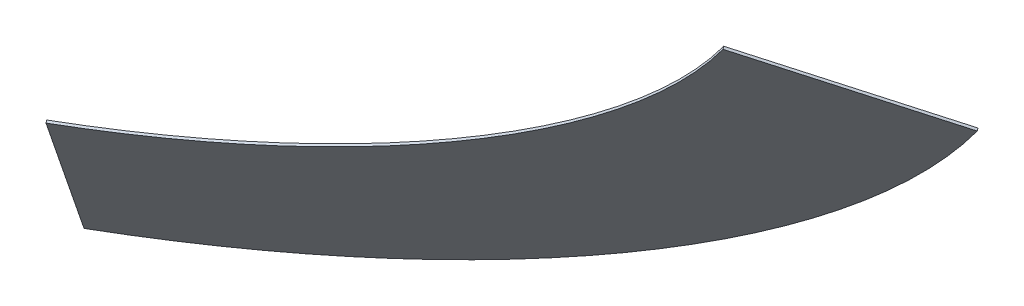
ISO-10303-21;
HEADER;
FILE_DESCRIPTION(('STEP AP214'),'2;1');
FILE_NAME('part.step','',(''),(''),'','','');
FILE_SCHEMA(('AUTOMOTIVE_DESIGN { 1 0 10303 214 1 1 1 1 }'));
ENDSEC;
DATA;
#1=APPLICATION_CONTEXT('core data for automotive mechanical design processes');
#2=APPLICATION_PROTOCOL_DEFINITION('international standard','automotive_design',2000,#1);
#3=PRODUCT_CONTEXT('',#1,'mechanical');
#4=PRODUCT('Part','Part','',(#3));
#5=PRODUCT_RELATED_PRODUCT_CATEGORY('part','',(#4));
#6=PRODUCT_DEFINITION_FORMATION('','',#4);
#7=PRODUCT_DEFINITION_CONTEXT('part definition',#1,'design');
#8=PRODUCT_DEFINITION('design','',#6,#7);
#9=PRODUCT_DEFINITION_SHAPE('','',#8);
#10=(LENGTH_UNIT() NAMED_UNIT(*) SI_UNIT(.MILLI.,.METRE.));
#11=(NAMED_UNIT(*) PLANE_ANGLE_UNIT() SI_UNIT($,.RADIAN.));
#12=(NAMED_UNIT(*) SI_UNIT($,.STERADIAN.) SOLID_ANGLE_UNIT());
#13=UNCERTAINTY_MEASURE_WITH_UNIT(LENGTH_MEASURE(1.E-05),#10,'distance_accuracy_value','');
#14=(GEOMETRIC_REPRESENTATION_CONTEXT(3) GLOBAL_UNCERTAINTY_ASSIGNED_CONTEXT((#13)) GLOBAL_UNIT_ASSIGNED_CONTEXT((#10,
#11,#12)) REPRESENTATION_CONTEXT('',''));
#15=CARTESIAN_POINT('',(0.,0.,0.));
#16=DIRECTION('',(0.,0.,1.));
#17=DIRECTION('',(1.,0.,0.));
#18=AXIS2_PLACEMENT_3D('',#15,#16,#17);
#19=CARTESIAN_POINT('',(-34.3905019136645,34.4201179433459,-59.5660966122609));
#20=DIRECTION('',(-0.866025403784436,0.,0.500000000000005));
#21=DIRECTION('',(-0.26973368571684,-0.842006505413373,-0.467192448174377));
#22=AXIS2_PLACEMENT_3D('',#19,#20,#21);
#23=PLANE('',#22);
#24=DIRECTION('',(0.421003252706691,-0.539467371433676,0.729199023839738));
#25=VECTOR('',#24,1.);
#26=CARTESIAN_POINT('',(-34.3905019136645,34.4201179433458,-59.566096612261));
#27=LINE('',#26,#25);
#28=CARTESIAN_POINT('',(-34.4957527268412,34.5549847862042,-59.7483963682209));
#29=VERTEX_POINT('',#28);
#30=CARTESIAN_POINT('',(-34.2852511004878,34.2852511004874,-59.3837968563011));
#31=VERTEX_POINT('',#30);
#32=EDGE_CURVE('E11',#29,#31,#27,.T.);
#33=ORIENTED_EDGE('',*,*,#32,.F.);
#34=DIRECTION('',(-0.26973368571684,-0.842006505413373,-0.467192448174377));
#35=VECTOR('',#34,1.);
#36=CARTESIAN_POINT('',(-34.4957527268412,34.5549847862043,-59.7483963682209));
#37=LINE('',#36,#35);
#38=CARTESIAN_POINT('',(-45.478906759032,0.269733685716755,-78.7717771793303));
#39=VERTEX_POINT('',#38);
#40=EDGE_CURVE('E75',#29,#39,#37,.T.);
#41=ORIENTED_EDGE('',*,*,#40,.T.);
#42=DIRECTION('',(0.421003252706691,-0.539467371433676,0.729199023839738));
#43=VECTOR('',#42,1.);
#44=CARTESIAN_POINT('',(-45.3736559458554,0.13486684285835,-78.5894774233703));
#45=LINE('',#44,#43);
#46=CARTESIAN_POINT('',(-45.2684051326787,0.,-78.4071776674104));
#47=VERTEX_POINT('',#46);
#48=EDGE_CURVE('E47',#39,#47,#45,.T.);
#49=ORIENTED_EDGE('',*,*,#48,.T.);
#50=DIRECTION('',(-0.26973368571684,-0.842006505413373,-0.467192448174377));
#51=VECTOR('',#50,1.);
#52=CARTESIAN_POINT('',(-34.2852511004878,34.2852511004875,-59.383796856301));
#53=LINE('',#52,#51);
#54=EDGE_CURVE('E77',#31,#47,#53,.T.);
#55=ORIENTED_EDGE('',*,*,#54,.F.);
#56=EDGE_LOOP('',(#33,#41,#49,#55));
#57=FACE_BOUND('',#56,.T.);
#58=ADVANCED_FACE('F37',(#57),#23,.T.);
#59=CARTESIAN_POINT('',(0.,141.77425229546,0.));
#60=DIRECTION('',(0.421003252706691,-0.539467371433676,0.729199023839737));
#61=DIRECTION('',(0.,-0.80391564512368,-0.5947433358394));
#62=AXIS2_PLACEMENT_3D('',#59,#60,#61);
#63=CYLINDRICAL_SURFACE('',#62,168.216497784736);
#64=ORIENTED_EDGE('',*,*,#48,.F.);
#65=CARTESIAN_POINT('',(-0.105250813176663,141.909119138318,-0.182299755959917));
#66=DIRECTION('',(0.421003252706691,-0.539467371433676,0.729199023839737));
#67=DIRECTION('',(0.,-0.80391564512368,-0.5947433358394));
#68=AXIS2_PLACEMENT_3D('',#65,#66,#67);
#69=CIRCLE('',#68,168.216497784736);
#70=CARTESIAN_POINT('',(112.275511987176,81.4590735245717,-109.786799046221));
#71=VERTEX_POINT('',#70);
#72=EDGE_CURVE('E89',#39,#71,#69,.T.);
#73=ORIENTED_EDGE('',*,*,#72,.T.);
#74=DIRECTION('',(0.421003252706691,-0.539467371433676,0.729199023839738));
#75=VECTOR('',#74,1.);
#76=CARTESIAN_POINT('',(112.380762800353,81.3242066817133,-109.604499290261));
#77=LINE('',#76,#75);
#78=CARTESIAN_POINT('',(112.486013613529,81.1893398388549,-109.422199534301));
#79=VERTEX_POINT('',#78);
#80=EDGE_CURVE('E98',#71,#79,#77,.T.);
#81=ORIENTED_EDGE('',*,*,#80,.T.);
#82=CARTESIAN_POINT('',(0.10525081317667,141.639385452602,0.182299755959937));
#83=DIRECTION('',(0.421003252706691,-0.539467371433676,0.729199023839737));
#84=DIRECTION('',(0.,-0.80391564512368,-0.5947433358394));
#85=AXIS2_PLACEMENT_3D('',#82,#83,#84);
#86=CIRCLE('',#85,168.216497784736);
#87=EDGE_CURVE('E93',#47,#79,#86,.T.);
#88=ORIENTED_EDGE('',*,*,#87,.F.);
#89=EDGE_LOOP('',(#64,#73,#81,#88));
#90=FACE_BOUND('',#89,.T.);
#91=ADVANCED_FACE('F106',(#90),#63,.T.);
#92=CARTESIAN_POINT('',(112.380762800353,81.3242066817133,-109.604499290261));
#93=DIRECTION('',(0.613543657971687,0.761469861349673,0.209112003526413));
#94=DIRECTION('',(-0.668072182457186,0.359358602811384,0.651568072892114));
#95=AXIS2_PLACEMENT_3D('',#92,#93,#94);
#96=PLANE('',#95);
#97=ORIENTED_EDGE('',*,*,#80,.F.);
#98=DIRECTION('',(-0.668072182457186,0.359358602811384,0.651568072892114));
#99=VECTOR('',#98,1.);
#100=CARTESIAN_POINT('',(112.275511987176,81.4590735245717,-109.786799046221));
#101=LINE('',#100,#99);
#102=CARTESIAN_POINT('',(85.0726075184626,96.0916207237884,-83.2559173433533));
#103=VERTEX_POINT('',#102);
#104=EDGE_CURVE('E91',#71,#103,#101,.T.);
#105=ORIENTED_EDGE('',*,*,#104,.T.);
#106=DIRECTION('',(0.421003252706691,-0.539467371433676,0.729199023839738));
#107=VECTOR('',#106,1.);
#108=CARTESIAN_POINT('',(85.1778583316392,95.95675388093,-83.0736175873934));
#109=LINE('',#108,#107);
#110=CARTESIAN_POINT('',(85.2831091448159,95.8218870380715,-82.8913178314335));
#111=VERTEX_POINT('',#110);
#112=EDGE_CURVE('E41',#103,#111,#109,.T.);
#113=ORIENTED_EDGE('',*,*,#112,.T.);
#114=DIRECTION('',(-0.668072182457186,0.359358602811384,0.651568072892114));
#115=VECTOR('',#114,1.);
#116=CARTESIAN_POINT('',(112.486013613529,81.1893398388548,-109.422199534301));
#117=LINE('',#116,#115);
#118=EDGE_CURVE('E107',#79,#111,#117,.T.);
#119=ORIENTED_EDGE('',*,*,#118,.F.);
#120=EDGE_LOOP('',(#97,#105,#113,#119));
#121=FACE_BOUND('',#120,.T.);
#122=ADVANCED_FACE('F111',(#121),#96,.T.);
#123=CARTESIAN_POINT('',(0.,141.77425229546,0.));
#124=DIRECTION('',(-0.421003252706691,0.539467371433676,-0.729199023839737));
#125=DIRECTION('',(0.,0.80391564512368,0.5947433358394));
#126=AXIS2_PLACEMENT_3D('',#123,#124,#125);
#127=CYLINDRICAL_SURFACE('',#126,127.4979868468);
#128=CARTESIAN_POINT('',(-0.105250813176663,141.909119138318,-0.182299755959917));
#129=DIRECTION('',(-0.421003252706691,0.539467371433676,-0.729199023839737));
#130=DIRECTION('',(0.,0.80391564512368,0.5947433358394));
#131=AXIS2_PLACEMENT_3D('',#128,#129,#130);
#132=CIRCLE('',#131,127.4979868468);
#133=EDGE_CURVE('E87',#103,#29,#132,.T.);
#134=ORIENTED_EDGE('',*,*,#133,.T.);
#135=ORIENTED_EDGE('',*,*,#32,.T.);
#136=CARTESIAN_POINT('',(0.10525081317667,141.639385452602,0.182299755959937));
#137=DIRECTION('',(-0.421003252706691,0.539467371433676,-0.729199023839737));
#138=DIRECTION('',(0.,0.80391564512368,0.5947433358394));
#139=AXIS2_PLACEMENT_3D('',#136,#137,#138);
#140=CIRCLE('',#139,127.4979868468);
#141=EDGE_CURVE('E105',#111,#31,#140,.T.);
#142=ORIENTED_EDGE('',*,*,#141,.F.);
#143=ORIENTED_EDGE('',*,*,#112,.F.);
#144=EDGE_LOOP('',(#134,#135,#142,#143));
#145=FACE_BOUND('',#144,.T.);
#146=ADVANCED_FACE('F39',(#145),#127,.F.);
#147=CARTESIAN_POINT('',(0.,141.310832238496,0.));
#148=DIRECTION('',(0.421003252706691,-0.539467371433676,0.729199023839738));
#149=DIRECTION('',(0.,-0.803915645123681,-0.5947433358394));
#150=AXIS2_PLACEMENT_3D('',#147,#148,#149);
#151=PLANE('',#150);
#152=ORIENTED_EDGE('',*,*,#118,.T.);
#153=ORIENTED_EDGE('',*,*,#141,.T.);
#154=ORIENTED_EDGE('',*,*,#54,.T.);
#155=ORIENTED_EDGE('',*,*,#87,.T.);
#156=EDGE_LOOP('',(#152,#153,#154,#155));
#157=FACE_BOUND('',#156,.T.);
#158=ADVANCED_FACE('F104',(#157),#151,.T.);
#159=CARTESIAN_POINT('',(-0.210501626353334,141.580565924213,-0.364599511919863));
#160=DIRECTION('',(0.421003252706691,-0.539467371433676,0.729199023839738));
#161=DIRECTION('',(0.,-0.803915645123681,-0.5947433358394));
#162=AXIS2_PLACEMENT_3D('',#159,#160,#161);
#163=PLANE('',#162);
#164=ORIENTED_EDGE('',*,*,#104,.F.);
#165=ORIENTED_EDGE('',*,*,#72,.F.);
#166=ORIENTED_EDGE('',*,*,#40,.F.);
#167=ORIENTED_EDGE('',*,*,#133,.F.);
#168=EDGE_LOOP('',(#164,#165,#166,#167));
#169=FACE_BOUND('',#168,.T.);
#170=ADVANCED_FACE('F86',(#169),#163,.F.);
#171=CLOSED_SHELL('',(#58,#91,#122,#146,#158,#170));
#172=MANIFOLD_SOLID_BREP('B2',#171);
#173=ADVANCED_BREP_SHAPE_REPRESENTATION('',(#18,#172),#14);
#174=SHAPE_DEFINITION_REPRESENTATION(#9,#173);
ENDSEC;
END-ISO-10303-21;
